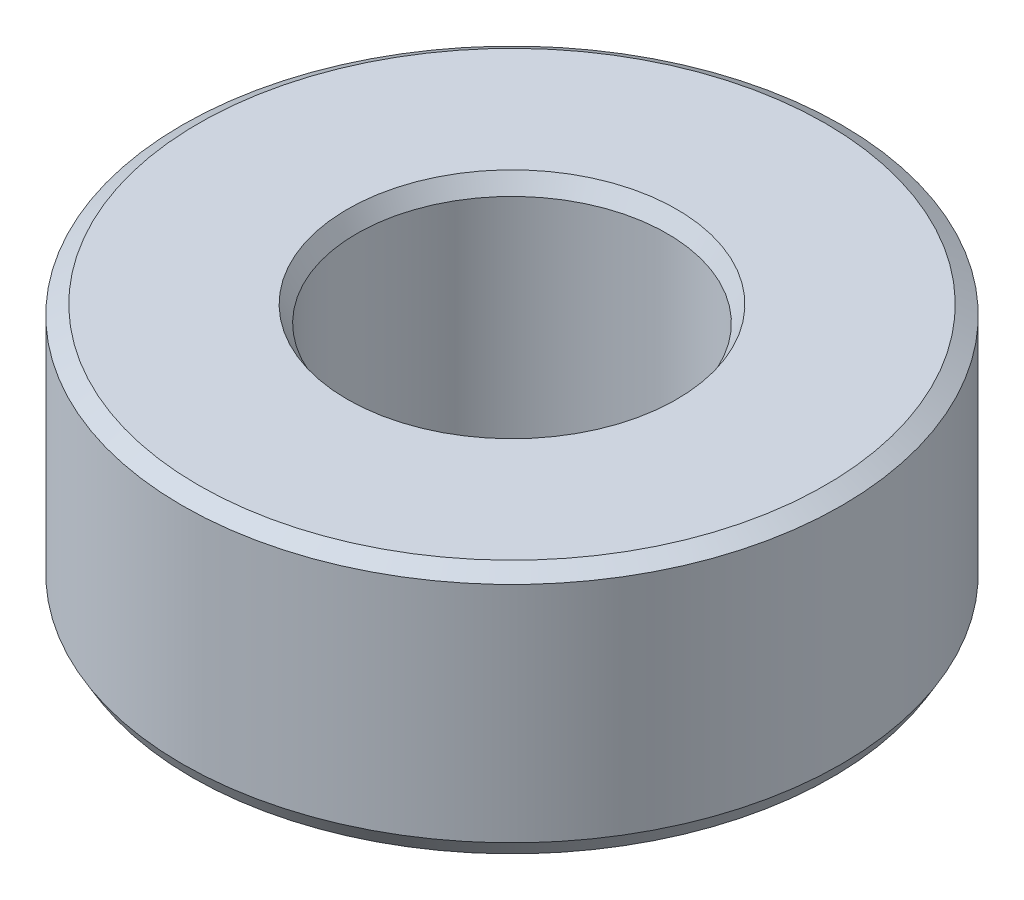
ISO-10303-21;
HEADER;
FILE_DESCRIPTION(('STEP AP214'),'2;1');
FILE_NAME('part.step','',(''),(''),'','','');
FILE_SCHEMA(('AUTOMOTIVE_DESIGN { 1 0 10303 214 1 1 1 1 }'));
ENDSEC;
DATA;
#1=APPLICATION_CONTEXT('core data for automotive mechanical design processes');
#2=APPLICATION_PROTOCOL_DEFINITION('international standard','automotive_design',2000,#1);
#3=PRODUCT_CONTEXT('',#1,'mechanical');
#4=PRODUCT('Part','Part','',(#3));
#5=PRODUCT_RELATED_PRODUCT_CATEGORY('part','',(#4));
#6=PRODUCT_DEFINITION_FORMATION('','',#4);
#7=PRODUCT_DEFINITION_CONTEXT('part definition',#1,'design');
#8=PRODUCT_DEFINITION('design','',#6,#7);
#9=PRODUCT_DEFINITION_SHAPE('','',#8);
#10=(LENGTH_UNIT() NAMED_UNIT(*) SI_UNIT(.MILLI.,.METRE.));
#11=(NAMED_UNIT(*) PLANE_ANGLE_UNIT() SI_UNIT($,.RADIAN.));
#12=(NAMED_UNIT(*) SI_UNIT($,.STERADIAN.) SOLID_ANGLE_UNIT());
#13=UNCERTAINTY_MEASURE_WITH_UNIT(LENGTH_MEASURE(1.E-05),#10,'distance_accuracy_value','');
#14=(GEOMETRIC_REPRESENTATION_CONTEXT(3) GLOBAL_UNCERTAINTY_ASSIGNED_CONTEXT((#13)) GLOBAL_UNIT_ASSIGNED_CONTEXT((#10,
#11,#12)) REPRESENTATION_CONTEXT('',''));
#15=CARTESIAN_POINT('',(0.,0.,0.));
#16=DIRECTION('',(0.,0.,1.));
#17=DIRECTION('',(1.,0.,0.));
#18=AXIS2_PLACEMENT_3D('',#15,#16,#17);
#19=CARTESIAN_POINT('',(0.,32.1654569748947,0.));
#20=DIRECTION('',(0.,-1.,0.));
#21=DIRECTION('',(0.,0.,-1.));
#22=AXIS2_PLACEMENT_3D('',#19,#20,#21);
#23=CYLINDRICAL_SURFACE('',#22,42.5);
#24=CARTESIAN_POINT('',(0.,2.09688517945562,0.));
#25=DIRECTION('',(0.,1.,0.));
#26=DIRECTION('',(0.,0.,1.));
#27=AXIS2_PLACEMENT_3D('',#24,#25,#26);
#28=CIRCLE('',#27,42.5);
#29=CARTESIAN_POINT('',(0.,2.09688517945562,42.5));
#30=VERTEX_POINT('',#29);
#31=EDGE_CURVE('E10',#30,#30,#28,.T.);
#32=ORIENTED_EDGE('',*,*,#31,.T.);
#33=EDGE_LOOP('',(#32));
#34=FACE_BOUND('',#33,.T.);
#35=CARTESIAN_POINT('',(0.,30.9362146849074,0.));
#36=DIRECTION('',(0.,1.,0.));
#37=DIRECTION('',(0.,0.,1.));
#38=AXIS2_PLACEMENT_3D('',#35,#36,#37);
#39=CIRCLE('',#38,42.5);
#40=CARTESIAN_POINT('',(0.,30.9362146849074,42.5));
#41=VERTEX_POINT('',#40);
#42=EDGE_CURVE('E50',#41,#41,#39,.F.);
#43=ORIENTED_EDGE('',*,*,#42,.T.);
#44=EDGE_LOOP('',(#43));
#45=FACE_BOUND('',#44,.T.);
#46=ADVANCED_FACE('F39',(#34,#45),#23,.T.);
#47=CARTESIAN_POINT('',(0.,32.1654569748947,0.));
#48=DIRECTION('',(0.,1.,0.));
#49=DIRECTION('',(0.,0.,1.));
#50=AXIS2_PLACEMENT_3D('',#47,#48,#49);
#51=PLANE('',#50);
#52=CARTESIAN_POINT('',(0.,32.1654569748947,0.));
#53=DIRECTION('',(0.,1.,0.));
#54=DIRECTION('',(0.,0.,1.));
#55=AXIS2_PLACEMENT_3D('',#52,#53,#54);
#56=CIRCLE('',#55,21.2299658446235);
#57=CARTESIAN_POINT('',(0.,32.1654569748947,21.2299658446235));
#58=VERTEX_POINT('',#57);
#59=EDGE_CURVE('E58',#58,#58,#56,.F.);
#60=ORIENTED_EDGE('',*,*,#59,.T.);
#61=EDGE_LOOP('',(#60));
#62=FACE_BOUND('',#61,.T.);
#63=CARTESIAN_POINT('',(0.,32.1654569748947,0.));
#64=DIRECTION('',(0.,1.,0.));
#65=DIRECTION('',(0.,0.,1.));
#66=AXIS2_PLACEMENT_3D('',#63,#64,#65);
#67=CIRCLE('',#66,40.4031148205443);
#68=CARTESIAN_POINT('',(0.,32.1654569748947,40.4031148205443));
#69=VERTEX_POINT('',#68);
#70=EDGE_CURVE('E61',#69,#69,#67,.T.);
#71=ORIENTED_EDGE('',*,*,#70,.T.);
#72=EDGE_LOOP('',(#71));
#73=FACE_BOUND('',#72,.T.);
#74=ADVANCED_FACE('F88',(#62,#73),#51,.T.);
#75=CARTESIAN_POINT('',(0.,0.,0.));
#76=DIRECTION('',(0.,1.,0.));
#77=DIRECTION('',(0.,0.,1.));
#78=AXIS2_PLACEMENT_3D('',#75,#76,#77);
#79=PLANE('',#78);
#80=CARTESIAN_POINT('',(0.,0.,0.));
#81=DIRECTION('',(0.,1.,0.));
#82=DIRECTION('',(0.,0.,1.));
#83=AXIS2_PLACEMENT_3D('',#80,#81,#82);
#84=CIRCLE('',#83,22.0976087340919);
#85=CARTESIAN_POINT('',(0.,0.,22.0976087340919));
#86=VERTEX_POINT('',#85);
#87=EDGE_CURVE('E51',#86,#86,#84,.T.);
#88=ORIENTED_EDGE('',*,*,#87,.T.);
#89=EDGE_LOOP('',(#88));
#90=FACE_BOUND('',#89,.T.);
#91=CARTESIAN_POINT('',(0.,0.,0.));
#92=DIRECTION('',(0.,1.,0.));
#93=DIRECTION('',(0.,0.,1.));
#94=AXIS2_PLACEMENT_3D('',#91,#92,#93);
#95=CIRCLE('',#94,41.2707577100128);
#96=CARTESIAN_POINT('',(0.,0.,41.2707577100128));
#97=VERTEX_POINT('',#96);
#98=EDGE_CURVE('E54',#97,#97,#95,.F.);
#99=ORIENTED_EDGE('',*,*,#98,.T.);
#100=EDGE_LOOP('',(#99));
#101=FACE_BOUND('',#100,.T.);
#102=ADVANCED_FACE('F83',(#90,#101),#79,.F.);
#103=CARTESIAN_POINT('',(0.,32.1654569748947,0.));
#104=DIRECTION('',(0.,-1.,0.));
#105=DIRECTION('',(0.,0.,-1.));
#106=AXIS2_PLACEMENT_3D('',#103,#104,#105);
#107=CYLINDRICAL_SURFACE('',#106,20.0007235546362);
#108=CARTESIAN_POINT('',(0.,30.068571795439,0.));
#109=DIRECTION('',(0.,1.,0.));
#110=DIRECTION('',(0.,0.,1.));
#111=AXIS2_PLACEMENT_3D('',#108,#109,#110);
#112=CIRCLE('',#111,20.0007235546362);
#113=CARTESIAN_POINT('',(0.,30.068571795439,20.0007235546362));
#114=VERTEX_POINT('',#113);
#115=EDGE_CURVE('E67',#114,#114,#112,.T.);
#116=ORIENTED_EDGE('',*,*,#115,.T.);
#117=EDGE_LOOP('',(#116));
#118=FACE_BOUND('',#117,.T.);
#119=CARTESIAN_POINT('',(0.,1.22924228998727,0.));
#120=DIRECTION('',(0.,1.,0.));
#121=DIRECTION('',(0.,0.,1.));
#122=AXIS2_PLACEMENT_3D('',#119,#120,#121);
#123=CIRCLE('',#122,20.0007235546362);
#124=CARTESIAN_POINT('',(0.,1.22924228998727,20.0007235546362));
#125=VERTEX_POINT('',#124);
#126=EDGE_CURVE('E69',#125,#125,#123,.F.);
#127=ORIENTED_EDGE('',*,*,#126,.T.);
#128=EDGE_LOOP('',(#127));
#129=FACE_BOUND('',#128,.T.);
#130=ADVANCED_FACE('F71',(#118,#129),#107,.F.);
#131=CARTESIAN_POINT('',(0.,30.068571795439,0.));
#132=DIRECTION('',(0.,1.,0.));
#133=DIRECTION('',(0.,0.,1.));
#134=AXIS2_PLACEMENT_3D('',#131,#132,#133);
#135=CONICAL_SURFACE('',#134,20.0007235546362,0.530227746798553);
#136=ORIENTED_EDGE('',*,*,#59,.F.);
#137=EDGE_LOOP('',(#136));
#138=FACE_BOUND('',#137,.T.);
#139=ORIENTED_EDGE('',*,*,#115,.F.);
#140=EDGE_LOOP('',(#139));
#141=FACE_BOUND('',#140,.T.);
#142=ADVANCED_FACE('F77',(#138,#141),#135,.F.);
#143=CARTESIAN_POINT('',(0.,0.,0.));
#144=DIRECTION('',(0.,-1.,0.));
#145=DIRECTION('',(0.,0.,-1.));
#146=AXIS2_PLACEMENT_3D('',#143,#144,#145);
#147=CONICAL_SURFACE('',#146,22.0976087340919,1.04056857999634);
#148=ORIENTED_EDGE('',*,*,#126,.F.);
#149=EDGE_LOOP('',(#148));
#150=FACE_BOUND('',#149,.T.);
#151=ORIENTED_EDGE('',*,*,#87,.F.);
#152=EDGE_LOOP('',(#151));
#153=FACE_BOUND('',#152,.T.);
#154=ADVANCED_FACE('F73',(#150,#153),#147,.F.);
#155=CARTESIAN_POINT('',(0.,2.09688517945562,0.));
#156=DIRECTION('',(0.,1.,0.));
#157=DIRECTION('',(0.,0.,1.));
#158=AXIS2_PLACEMENT_3D('',#155,#156,#157);
#159=CONICAL_SURFACE('',#158,42.5,0.530227746798555);
#160=ORIENTED_EDGE('',*,*,#98,.F.);
#161=EDGE_LOOP('',(#160));
#162=FACE_BOUND('',#161,.T.);
#163=ORIENTED_EDGE('',*,*,#31,.F.);
#164=EDGE_LOOP('',(#163));
#165=FACE_BOUND('',#164,.T.);
#166=ADVANCED_FACE('F76',(#162,#165),#159,.T.);
#167=CARTESIAN_POINT('',(0.,32.1654569748947,0.));
#168=DIRECTION('',(0.,-1.,0.));
#169=DIRECTION('',(0.,0.,-1.));
#170=AXIS2_PLACEMENT_3D('',#167,#168,#169);
#171=CONICAL_SURFACE('',#170,40.4031148205443,1.04056857999634);
#172=ORIENTED_EDGE('',*,*,#42,.F.);
#173=EDGE_LOOP('',(#172));
#174=FACE_BOUND('',#173,.T.);
#175=ORIENTED_EDGE('',*,*,#70,.F.);
#176=EDGE_LOOP('',(#175));
#177=FACE_BOUND('',#176,.T.);
#178=ADVANCED_FACE('F45',(#174,#177),#171,.T.);
#179=CLOSED_SHELL('',(#46,#74,#102,#130,#142,#154,#166,#178));
#180=MANIFOLD_SOLID_BREP('B2',#179);
#181=ADVANCED_BREP_SHAPE_REPRESENTATION('',(#18,#180),#14);
#182=SHAPE_DEFINITION_REPRESENTATION(#9,#181);
ENDSEC;
END-ISO-10303-21;
